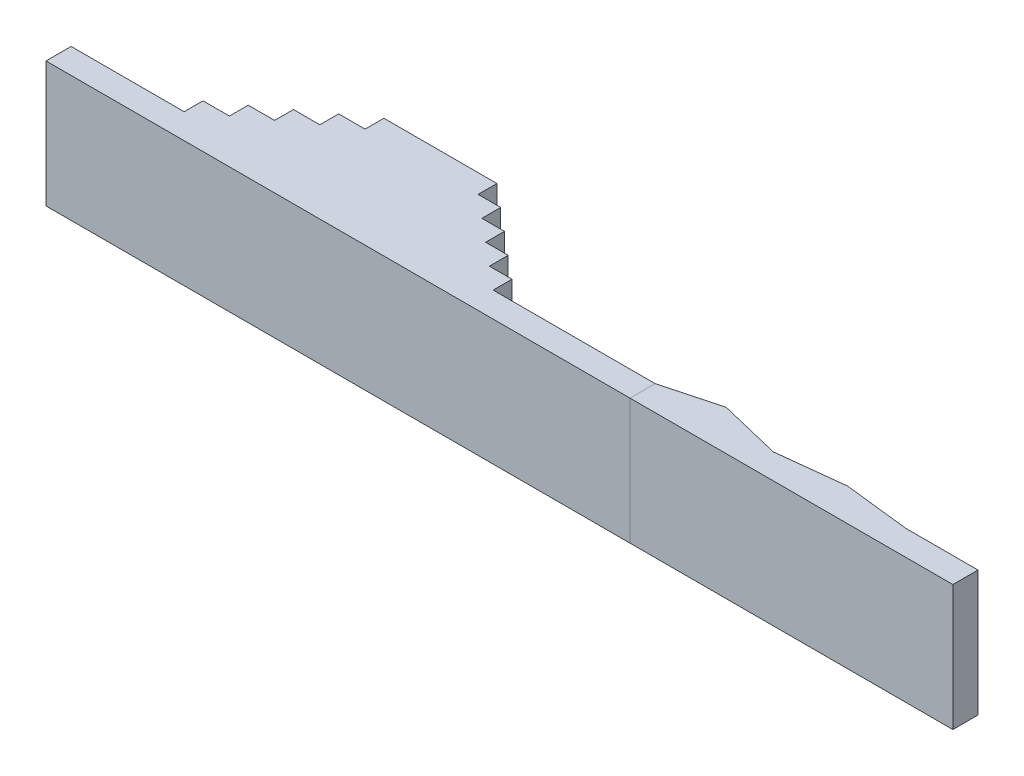
ISO-10303-21;
HEADER;
FILE_DESCRIPTION(('STEP AP214'),'2;1');
FILE_NAME('part.step','',(''),(''),'','','');
FILE_SCHEMA(('AUTOMOTIVE_DESIGN { 1 0 10303 214 1 1 1 1 }'));
ENDSEC;
DATA;
#1=APPLICATION_CONTEXT('core data for automotive mechanical design processes');
#2=APPLICATION_PROTOCOL_DEFINITION('international standard','automotive_design',2000,#1);
#3=PRODUCT_CONTEXT('',#1,'mechanical');
#4=PRODUCT('Part','Part','',(#3));
#5=PRODUCT_RELATED_PRODUCT_CATEGORY('part','',(#4));
#6=PRODUCT_DEFINITION_FORMATION('','',#4);
#7=PRODUCT_DEFINITION_CONTEXT('part definition',#1,'design');
#8=PRODUCT_DEFINITION('design','',#6,#7);
#9=PRODUCT_DEFINITION_SHAPE('','',#8);
#10=(LENGTH_UNIT() NAMED_UNIT(*) SI_UNIT(.MILLI.,.METRE.));
#11=(NAMED_UNIT(*) PLANE_ANGLE_UNIT() SI_UNIT($,.RADIAN.));
#12=(NAMED_UNIT(*) SI_UNIT($,.STERADIAN.) SOLID_ANGLE_UNIT());
#13=UNCERTAINTY_MEASURE_WITH_UNIT(LENGTH_MEASURE(1.E-05),#10,'distance_accuracy_value','');
#14=(GEOMETRIC_REPRESENTATION_CONTEXT(3) GLOBAL_UNCERTAINTY_ASSIGNED_CONTEXT((#13)) GLOBAL_UNIT_ASSIGNED_CONTEXT((#10,
#11,#12)) REPRESENTATION_CONTEXT('',''));
#15=CARTESIAN_POINT('',(0.,0.,0.));
#16=DIRECTION('',(0.,0.,1.));
#17=DIRECTION('',(1.,0.,0.));
#18=AXIS2_PLACEMENT_3D('',#15,#16,#17);
#19=CARTESIAN_POINT('',(3750.,0.,200.));
#20=DIRECTION('',(-1.,0.,0.));
#21=DIRECTION('',(0.,0.,1.));
#22=AXIS2_PLACEMENT_3D('',#19,#20,#21);
#23=PLANE('',#22);
#24=DIRECTION('',(0.,0.,1.));
#25=VECTOR('',#24,1.);
#26=CARTESIAN_POINT('',(3750.,1000.,200.));
#27=LINE('',#26,#25);
#28=CARTESIAN_POINT('',(3750.,1000.,0.));
#29=VERTEX_POINT('',#28);
#30=CARTESIAN_POINT('',(3750.,1000.,200.));
#31=VERTEX_POINT('',#30);
#32=EDGE_CURVE('E140',#29,#31,#27,.T.);
#33=ORIENTED_EDGE('',*,*,#32,.F.);
#34=DIRECTION('',(0.,1.,0.));
#35=VECTOR('',#34,1.);
#36=CARTESIAN_POINT('',(3750.,0.,0.));
#37=LINE('',#36,#35);
#38=CARTESIAN_POINT('',(3750.,0.,0.));
#39=VERTEX_POINT('',#38);
#40=EDGE_CURVE('E12',#39,#29,#37,.T.);
#41=ORIENTED_EDGE('',*,*,#40,.F.);
#42=DIRECTION('',(0.,0.,1.));
#43=VECTOR('',#42,1.);
#44=CARTESIAN_POINT('',(3750.,0.,200.));
#45=LINE('',#44,#43);
#46=CARTESIAN_POINT('',(3750.,0.,200.));
#47=VERTEX_POINT('',#46);
#48=EDGE_CURVE('E160',#39,#47,#45,.T.);
#49=ORIENTED_EDGE('',*,*,#48,.T.);
#50=DIRECTION('',(0.,1.,0.));
#51=VECTOR('',#50,1.);
#52=CARTESIAN_POINT('',(3750.,0.,200.));
#53=LINE('',#52,#51);
#54=EDGE_CURVE('E46',#47,#31,#53,.T.);
#55=ORIENTED_EDGE('',*,*,#54,.T.);
#56=EDGE_LOOP('',(#33,#41,#49,#55));
#57=FACE_BOUND('',#56,.T.);
#58=ADVANCED_FACE('F43',(#57),#23,.T.);
#59=CARTESIAN_POINT('',(3750.,0.,0.));
#60=DIRECTION('',(-0.25889091197546,0.,-0.965906566752973));
#61=DIRECTION('',(-0.965906566752973,0.,0.25889091197546));
#62=AXIS2_PLACEMENT_3D('',#59,#60,#61);
#63=PLANE('',#62);
#64=DIRECTION('',(-0.965906566752973,0.,0.25889091197546));
#65=VECTOR('',#64,1.);
#66=CARTESIAN_POINT('',(3750.,1000.,0.));
#67=LINE('',#66,#65);
#68=CARTESIAN_POINT('',(4196.04330054707,1000.,-119.552512462324));
#69=VERTEX_POINT('',#68);
#70=EDGE_CURVE('E158',#69,#29,#67,.T.);
#71=ORIENTED_EDGE('',*,*,#70,.F.);
#72=DIRECTION('',(0.,1.,0.));
#73=VECTOR('',#72,1.);
#74=CARTESIAN_POINT('',(4196.04330054707,0.,-119.552512462324));
#75=LINE('',#74,#73);
#76=CARTESIAN_POINT('',(4196.04330054707,0.,-119.552512462324));
#77=VERTEX_POINT('',#76);
#78=EDGE_CURVE('E52',#77,#69,#75,.T.);
#79=ORIENTED_EDGE('',*,*,#78,.F.);
#80=DIRECTION('',(-0.965906566752973,0.,0.25889091197546));
#81=VECTOR('',#80,1.);
#82=CARTESIAN_POINT('',(3750.,0.,0.));
#83=LINE('',#82,#81);
#84=EDGE_CURVE('E130',#77,#39,#83,.T.);
#85=ORIENTED_EDGE('',*,*,#84,.T.);
#86=ORIENTED_EDGE('',*,*,#40,.T.);
#87=EDGE_LOOP('',(#71,#79,#85,#86));
#88=FACE_BOUND('',#87,.T.);
#89=ADVANCED_FACE('F172',(#88),#63,.T.);
#90=CARTESIAN_POINT('',(4196.04330054707,0.,-119.552512462324));
#91=DIRECTION('',(0.23574080449088,0.,-0.97181596668196));
#92=DIRECTION('',(-0.97181596668196,0.,-0.23574080449088));
#93=AXIS2_PLACEMENT_3D('',#90,#91,#92);
#94=PLANE('',#93);
#95=DIRECTION('',(-0.97181596668196,0.,-0.23574080449088));
#96=VECTOR('',#95,1.);
#97=CARTESIAN_POINT('',(4196.04330054707,1000.,-119.552512462324));
#98=LINE('',#97,#96);
#99=CARTESIAN_POINT('',(4688.88560130509,1000.,0.));
#100=VERTEX_POINT('',#99);
#101=EDGE_CURVE('E117',#100,#69,#98,.T.);
#102=ORIENTED_EDGE('',*,*,#101,.F.);
#103=DIRECTION('',(0.,1.,0.));
#104=VECTOR('',#103,1.);
#105=CARTESIAN_POINT('',(4688.88560130509,0.,0.));
#106=LINE('',#105,#104);
#107=CARTESIAN_POINT('',(4688.88560130509,0.,0.));
#108=VERTEX_POINT('',#107);
#109=EDGE_CURVE('E112',#108,#100,#106,.T.);
#110=ORIENTED_EDGE('',*,*,#109,.F.);
#111=DIRECTION('',(-0.97181596668196,0.,-0.23574080449088));
#112=VECTOR('',#111,1.);
#113=CARTESIAN_POINT('',(4196.04330054707,0.,-119.552512462324));
#114=LINE('',#113,#112);
#115=EDGE_CURVE('E115',#108,#77,#114,.T.);
#116=ORIENTED_EDGE('',*,*,#115,.T.);
#117=ORIENTED_EDGE('',*,*,#78,.T.);
#118=EDGE_LOOP('',(#102,#110,#116,#117));
#119=FACE_BOUND('',#118,.T.);
#120=ADVANCED_FACE('F114',(#119),#94,.T.);
#121=CARTESIAN_POINT('',(4688.88560130509,0.,0.));
#122=DIRECTION('',(-0.111047419581196,0.,-0.993815108862991));
#123=DIRECTION('',(-0.993815108862991,0.,0.111047419581196));
#124=AXIS2_PLACEMENT_3D('',#121,#122,#123);
#125=PLANE('',#124);
#126=DIRECTION('',(-0.993815108862991,0.,0.111047419581196));
#127=VECTOR('',#126,1.);
#128=CARTESIAN_POINT('',(4688.88560130509,1000.,0.));
#129=LINE('',#128,#127);
#130=CARTESIAN_POINT('',(5223.85117563217,1000.,-59.7762562311622));
#131=VERTEX_POINT('',#130);
#132=EDGE_CURVE('E155',#131,#100,#129,.T.);
#133=ORIENTED_EDGE('',*,*,#132,.F.);
#134=DIRECTION('',(0.,1.,0.));
#135=VECTOR('',#134,1.);
#136=CARTESIAN_POINT('',(5223.85117563217,0.,-59.7762562311622));
#137=LINE('',#136,#135);
#138=CARTESIAN_POINT('',(5223.85117563217,0.,-59.7762562311622));
#139=VERTEX_POINT('',#138);
#140=EDGE_CURVE('E122',#139,#131,#137,.T.);
#141=ORIENTED_EDGE('',*,*,#140,.F.);
#142=DIRECTION('',(-0.993815108862991,0.,0.111047419581196));
#143=VECTOR('',#142,1.);
#144=CARTESIAN_POINT('',(4688.88560130509,0.,0.));
#145=LINE('',#144,#143);
#146=EDGE_CURVE('E128',#139,#108,#145,.T.);
#147=ORIENTED_EDGE('',*,*,#146,.T.);
#148=ORIENTED_EDGE('',*,*,#109,.T.);
#149=EDGE_LOOP('',(#133,#141,#147,#148));
#150=FACE_BOUND('',#149,.T.);
#151=ADVANCED_FACE('F132',(#150),#125,.T.);
#152=CARTESIAN_POINT('',(5223.85117563217,0.,-59.7762562311622));
#153=DIRECTION('',(0.113699723972013,0.,-0.993515159808187));
#154=DIRECTION('',(-0.993515159808187,0.,-0.113699723972013));
#155=AXIS2_PLACEMENT_3D('',#152,#153,#154);
#156=PLANE('',#155);
#157=DIRECTION('',(-0.993515159808187,0.,-0.113699723972013));
#158=VECTOR('',#157,1.);
#159=CARTESIAN_POINT('',(5223.85117563217,1000.,-59.7762562311622));
#160=LINE('',#159,#158);
#161=CARTESIAN_POINT('',(5746.17976788853,1000.,0.));
#162=VERTEX_POINT('',#161);
#163=EDGE_CURVE('E152',#162,#131,#160,.T.);
#164=ORIENTED_EDGE('',*,*,#163,.F.);
#165=DIRECTION('',(0.,1.,0.));
#166=VECTOR('',#165,1.);
#167=CARTESIAN_POINT('',(5746.17976788853,0.,0.));
#168=LINE('',#167,#166);
#169=CARTESIAN_POINT('',(5746.17976788853,0.,0.));
#170=VERTEX_POINT('',#169);
#171=EDGE_CURVE('E164',#170,#162,#168,.T.);
#172=ORIENTED_EDGE('',*,*,#171,.F.);
#173=DIRECTION('',(-0.993515159808187,0.,-0.113699723972013));
#174=VECTOR('',#173,1.);
#175=CARTESIAN_POINT('',(5223.85117563217,0.,-59.7762562311622));
#176=LINE('',#175,#174);
#177=EDGE_CURVE('E133',#170,#139,#176,.T.);
#178=ORIENTED_EDGE('',*,*,#177,.T.);
#179=ORIENTED_EDGE('',*,*,#140,.T.);
#180=EDGE_LOOP('',(#164,#172,#178,#179));
#181=FACE_BOUND('',#180,.T.);
#182=ADVANCED_FACE('F185',(#181),#156,.T.);
#183=CARTESIAN_POINT('',(5746.17976788853,0.,0.));
#184=DIRECTION('',(0.,0.,-1.));
#185=DIRECTION('',(-1.,0.,0.));
#186=AXIS2_PLACEMENT_3D('',#183,#184,#185);
#187=PLANE('',#186);
#188=DIRECTION('',(-1.,0.,0.));
#189=VECTOR('',#188,1.);
#190=CARTESIAN_POINT('',(5746.17976788853,1000.,0.));
#191=LINE('',#190,#189);
#192=CARTESIAN_POINT('',(6320.,1000.,0.));
#193=VERTEX_POINT('',#192);
#194=EDGE_CURVE('E149',#193,#162,#191,.T.);
#195=ORIENTED_EDGE('',*,*,#194,.F.);
#196=DIRECTION('',(0.,1.,0.));
#197=VECTOR('',#196,1.);
#198=CARTESIAN_POINT('',(6320.,0.,0.));
#199=LINE('',#198,#197);
#200=CARTESIAN_POINT('',(6320.,0.,0.));
#201=VERTEX_POINT('',#200);
#202=EDGE_CURVE('E166',#201,#193,#199,.T.);
#203=ORIENTED_EDGE('',*,*,#202,.F.);
#204=DIRECTION('',(-1.,0.,0.));
#205=VECTOR('',#204,1.);
#206=CARTESIAN_POINT('',(5746.17976788853,0.,0.));
#207=LINE('',#206,#205);
#208=EDGE_CURVE('E135',#201,#170,#207,.T.);
#209=ORIENTED_EDGE('',*,*,#208,.T.);
#210=ORIENTED_EDGE('',*,*,#171,.T.);
#211=EDGE_LOOP('',(#195,#203,#209,#210));
#212=FACE_BOUND('',#211,.T.);
#213=ADVANCED_FACE('F188',(#212),#187,.T.);
#214=CARTESIAN_POINT('',(6320.,0.,200.));
#215=DIRECTION('',(1.,0.,0.));
#216=DIRECTION('',(0.,0.,-1.));
#217=AXIS2_PLACEMENT_3D('',#214,#215,#216);
#218=PLANE('',#217);
#219=DIRECTION('',(0.,0.,-1.));
#220=VECTOR('',#219,1.);
#221=CARTESIAN_POINT('',(6320.,1000.,200.));
#222=LINE('',#221,#220);
#223=CARTESIAN_POINT('',(6320.,1000.,200.));
#224=VERTEX_POINT('',#223);
#225=EDGE_CURVE('E146',#224,#193,#222,.T.);
#226=ORIENTED_EDGE('',*,*,#225,.F.);
#227=DIRECTION('',(0.,1.,0.));
#228=VECTOR('',#227,1.);
#229=CARTESIAN_POINT('',(6320.,0.,200.));
#230=LINE('',#229,#228);
#231=CARTESIAN_POINT('',(6320.,0.,200.));
#232=VERTEX_POINT('',#231);
#233=EDGE_CURVE('E167',#232,#224,#230,.T.);
#234=ORIENTED_EDGE('',*,*,#233,.F.);
#235=DIRECTION('',(0.,0.,-1.));
#236=VECTOR('',#235,1.);
#237=CARTESIAN_POINT('',(6320.,0.,200.));
#238=LINE('',#237,#236);
#239=EDGE_CURVE('E263',#232,#201,#238,.T.);
#240=ORIENTED_EDGE('',*,*,#239,.T.);
#241=ORIENTED_EDGE('',*,*,#202,.T.);
#242=EDGE_LOOP('',(#226,#234,#240,#241));
#243=FACE_BOUND('',#242,.T.);
#244=ADVANCED_FACE('F192',(#243),#218,.T.);
#245=CARTESIAN_POINT('',(3750.,0.,200.));
#246=DIRECTION('',(0.,0.,1.));
#247=DIRECTION('',(1.,0.,0.));
#248=AXIS2_PLACEMENT_3D('',#245,#246,#247);
#249=PLANE('',#248);
#250=DIRECTION('',(1.,0.,0.));
#251=VECTOR('',#250,1.);
#252=CARTESIAN_POINT('',(3750.,1000.,200.));
#253=LINE('',#252,#251);
#254=EDGE_CURVE('E143',#31,#224,#253,.T.);
#255=ORIENTED_EDGE('',*,*,#254,.F.);
#256=ORIENTED_EDGE('',*,*,#54,.F.);
#257=DIRECTION('',(1.,0.,0.));
#258=VECTOR('',#257,1.);
#259=CARTESIAN_POINT('',(3750.,0.,200.));
#260=LINE('',#259,#258);
#261=EDGE_CURVE('E264',#47,#232,#260,.T.);
#262=ORIENTED_EDGE('',*,*,#261,.T.);
#263=ORIENTED_EDGE('',*,*,#233,.T.);
#264=EDGE_LOOP('',(#255,#256,#262,#263));
#265=FACE_BOUND('',#264,.T.);
#266=ADVANCED_FACE('F169',(#265),#249,.T.);
#267=CARTESIAN_POINT('',(0.,0.,0.));
#268=DIRECTION('',(0.,-1.,0.));
#269=DIRECTION('',(0.,0.,-1.));
#270=AXIS2_PLACEMENT_3D('',#267,#268,#269);
#271=PLANE('',#270);
#272=ORIENTED_EDGE('',*,*,#48,.F.);
#273=ORIENTED_EDGE('',*,*,#84,.F.);
#274=ORIENTED_EDGE('',*,*,#115,.F.);
#275=ORIENTED_EDGE('',*,*,#146,.F.);
#276=ORIENTED_EDGE('',*,*,#177,.F.);
#277=ORIENTED_EDGE('',*,*,#208,.F.);
#278=ORIENTED_EDGE('',*,*,#239,.F.);
#279=ORIENTED_EDGE('',*,*,#261,.F.);
#280=EDGE_LOOP('',(#272,#273,#274,#275,#276,#277,#278,#279));
#281=FACE_BOUND('',#280,.T.);
#282=ADVANCED_FACE('F126',(#281),#271,.T.);
#283=CARTESIAN_POINT('',(0.,1000.,0.));
#284=DIRECTION('',(0.,-1.,0.));
#285=DIRECTION('',(0.,0.,-1.));
#286=AXIS2_PLACEMENT_3D('',#283,#284,#285);
#287=PLANE('',#286);
#288=ORIENTED_EDGE('',*,*,#32,.T.);
#289=ORIENTED_EDGE('',*,*,#254,.T.);
#290=ORIENTED_EDGE('',*,*,#225,.T.);
#291=ORIENTED_EDGE('',*,*,#194,.T.);
#292=ORIENTED_EDGE('',*,*,#163,.T.);
#293=ORIENTED_EDGE('',*,*,#132,.T.);
#294=ORIENTED_EDGE('',*,*,#101,.T.);
#295=ORIENTED_EDGE('',*,*,#70,.T.);
#296=EDGE_LOOP('',(#288,#289,#290,#291,#292,#293,#294,#295));
#297=FACE_BOUND('',#296,.T.);
#298=ADVANCED_FACE('F171',(#297),#287,.F.);
#299=CLOSED_SHELL('',(#58,#89,#120,#151,#182,#213,#244,#266,#282,#298));
#300=MANIFOLD_SOLID_BREP('B2',#299);
#301=CARTESIAN_POINT('',(0.,1000.,0.));
#302=DIRECTION('',(0.,0.,1.));
#303=DIRECTION('',(1.,0.,0.));
#304=AXIS2_PLACEMENT_3D('',#301,#302,#303);
#305=PLANE('',#304);
#306=DIRECTION('',(-1.,0.,0.));
#307=VECTOR('',#306,1.);
#308=CARTESIAN_POINT('',(0.,0.,0.));
#309=LINE('',#308,#307);
#310=CARTESIAN_POINT('',(0.,0.,0.));
#311=VERTEX_POINT('',#310);
#312=CARTESIAN_POINT('',(-900.,0.,1.10218211923262E-13));
#313=VERTEX_POINT('',#312);
#314=EDGE_CURVE('E463',#311,#313,#309,.T.);
#315=ORIENTED_EDGE('',*,*,#314,.T.);
#316=DIRECTION('',(0.,-1.,0.));
#317=VECTOR('',#316,1.);
#318=CARTESIAN_POINT('',(-900.,1000.,1.10218211923262E-13));
#319=LINE('',#318,#317);
#320=CARTESIAN_POINT('',(-900.,1000.,1.10218211923262E-13));
#321=VERTEX_POINT('',#320);
#322=EDGE_CURVE('E41',#321,#313,#319,.T.);
#323=ORIENTED_EDGE('',*,*,#322,.F.);
#324=DIRECTION('',(-1.,0.,0.));
#325=VECTOR('',#324,1.);
#326=CARTESIAN_POINT('',(0.,1000.,0.));
#327=LINE('',#326,#325);
#328=CARTESIAN_POINT('',(0.,1000.,0.));
#329=VERTEX_POINT('',#328);
#330=EDGE_CURVE('E509',#329,#321,#327,.T.);
#331=ORIENTED_EDGE('',*,*,#330,.F.);
#332=DIRECTION('',(0.,-1.,0.));
#333=VECTOR('',#332,1.);
#334=CARTESIAN_POINT('',(0.,1000.,0.));
#335=LINE('',#334,#333);
#336=EDGE_CURVE('E459',#329,#311,#335,.T.);
#337=ORIENTED_EDGE('',*,*,#336,.T.);
#338=EDGE_LOOP('',(#315,#323,#331,#337));
#339=FACE_BOUND('',#338,.T.);
#340=ADVANCED_FACE('F271',(#339),#305,.F.);
#341=CARTESIAN_POINT('',(-900.,1000.,1.10218211923262E-13));
#342=DIRECTION('',(1.,0.,0.));
#343=DIRECTION('',(0.,0.,-1.));
#344=AXIS2_PLACEMENT_3D('',#341,#342,#343);
#345=PLANE('',#344);
#346=DIRECTION('',(0.,0.,1.));
#347=VECTOR('',#346,1.);
#348=CARTESIAN_POINT('',(-900.,0.,1.10218211923262E-13));
#349=LINE('',#348,#347);
#350=CARTESIAN_POINT('',(-900.,0.,200.));
#351=VERTEX_POINT('',#350);
#352=EDGE_CURVE('E466',#313,#351,#349,.T.);
#353=ORIENTED_EDGE('',*,*,#352,.T.);
#354=DIRECTION('',(0.,-1.,0.));
#355=VECTOR('',#354,1.);
#356=CARTESIAN_POINT('',(-900.,1000.,200.));
#357=LINE('',#356,#355);
#358=CARTESIAN_POINT('',(-900.,1000.,200.));
#359=VERTEX_POINT('',#358);
#360=EDGE_CURVE('E279',#359,#351,#357,.T.);
#361=ORIENTED_EDGE('',*,*,#360,.F.);
#362=DIRECTION('',(0.,0.,1.));
#363=VECTOR('',#362,1.);
#364=CARTESIAN_POINT('',(-900.,1000.,1.10218211923262E-13));
#365=LINE('',#364,#363);
#366=EDGE_CURVE('E378',#321,#359,#365,.T.);
#367=ORIENTED_EDGE('',*,*,#366,.F.);
#368=ORIENTED_EDGE('',*,*,#322,.T.);
#369=EDGE_LOOP('',(#353,#361,#367,#368));
#370=FACE_BOUND('',#369,.T.);
#371=ADVANCED_FACE('F647',(#370),#345,.F.);
#372=CARTESIAN_POINT('',(-900.,1000.,200.));
#373=DIRECTION('',(0.,0.,-1.));
#374=DIRECTION('',(-1.,0.,0.));
#375=AXIS2_PLACEMENT_3D('',#372,#373,#374);
#376=PLANE('',#375);
#377=DIRECTION('',(1.,0.,0.));
#378=VECTOR('',#377,1.);
#379=CARTESIAN_POINT('',(-900.,0.,200.));
#380=LINE('',#379,#378);
#381=CARTESIAN_POINT('',(3750.,0.,200.));
#382=VERTEX_POINT('',#381);
#383=EDGE_CURVE('E468',#351,#382,#380,.T.);
#384=ORIENTED_EDGE('',*,*,#383,.T.);
#385=DIRECTION('',(0.,-1.,0.));
#386=VECTOR('',#385,1.);
#387=CARTESIAN_POINT('',(3750.,1000.,200.));
#388=LINE('',#387,#386);
#389=CARTESIAN_POINT('',(3750.,1000.,200.));
#390=VERTEX_POINT('',#389);
#391=EDGE_CURVE('E564',#390,#382,#388,.T.);
#392=ORIENTED_EDGE('',*,*,#391,.F.);
#393=DIRECTION('',(1.,0.,0.));
#394=VECTOR('',#393,1.);
#395=CARTESIAN_POINT('',(-900.,1000.,200.));
#396=LINE('',#395,#394);
#397=EDGE_CURVE('E572',#359,#390,#396,.T.);
#398=ORIENTED_EDGE('',*,*,#397,.F.);
#399=ORIENTED_EDGE('',*,*,#360,.T.);
#400=EDGE_LOOP('',(#384,#392,#398,#399));
#401=FACE_BOUND('',#400,.T.);
#402=ADVANCED_FACE('F570',(#401),#376,.F.);
#403=CARTESIAN_POINT('',(3750.,1000.,0.));
#404=DIRECTION('',(-1.,0.,0.));
#405=DIRECTION('',(0.,0.,1.));
#406=AXIS2_PLACEMENT_3D('',#403,#404,#405);
#407=PLANE('',#406);
#408=DIRECTION('',(0.,0.,-1.));
#409=VECTOR('',#408,1.);
#410=CARTESIAN_POINT('',(3750.,0.,0.));
#411=LINE('',#410,#409);
#412=CARTESIAN_POINT('',(3750.,0.,0.));
#413=VERTEX_POINT('',#412);
#414=EDGE_CURVE('E470',#382,#413,#411,.T.);
#415=ORIENTED_EDGE('',*,*,#414,.T.);
#416=DIRECTION('',(0.,-1.,0.));
#417=VECTOR('',#416,1.);
#418=CARTESIAN_POINT('',(3750.,1000.,0.));
#419=LINE('',#418,#417);
#420=CARTESIAN_POINT('',(3750.,1000.,0.));
#421=VERTEX_POINT('',#420);
#422=EDGE_CURVE('E561',#421,#413,#419,.T.);
#423=ORIENTED_EDGE('',*,*,#422,.F.);
#424=DIRECTION('',(0.,0.,-1.));
#425=VECTOR('',#424,1.);
#426=CARTESIAN_POINT('',(3750.,1000.,0.));
#427=LINE('',#426,#425);
#428=EDGE_CURVE('E590',#390,#421,#427,.T.);
#429=ORIENTED_EDGE('',*,*,#428,.F.);
#430=ORIENTED_EDGE('',*,*,#391,.T.);
#431=EDGE_LOOP('',(#415,#423,#429,#430));
#432=FACE_BOUND('',#431,.T.);
#433=ADVANCED_FACE('F581',(#432),#407,.F.);
#434=CARTESIAN_POINT('',(2460.,1000.,0.));
#435=DIRECTION('',(0.,0.,1.));
#436=DIRECTION('',(1.,0.,0.));
#437=AXIS2_PLACEMENT_3D('',#434,#435,#436);
#438=PLANE('',#437);
#439=DIRECTION('',(-1.,0.,0.));
#440=VECTOR('',#439,1.);
#441=CARTESIAN_POINT('',(2460.,0.,0.));
#442=LINE('',#441,#440);
#443=CARTESIAN_POINT('',(2460.,0.,0.));
#444=VERTEX_POINT('',#443);
#445=EDGE_CURVE('E472',#413,#444,#442,.T.);
#446=ORIENTED_EDGE('',*,*,#445,.T.);
#447=DIRECTION('',(0.,-1.,0.));
#448=VECTOR('',#447,1.);
#449=CARTESIAN_POINT('',(2460.,1000.,0.));
#450=LINE('',#449,#448);
#451=CARTESIAN_POINT('',(2460.,1000.,0.));
#452=VERTEX_POINT('',#451);
#453=EDGE_CURVE('E558',#452,#444,#450,.T.);
#454=ORIENTED_EDGE('',*,*,#453,.F.);
#455=DIRECTION('',(-1.,0.,0.));
#456=VECTOR('',#455,1.);
#457=CARTESIAN_POINT('',(2460.,1000.,0.));
#458=LINE('',#457,#456);
#459=EDGE_CURVE('E587',#421,#452,#458,.T.);
#460=ORIENTED_EDGE('',*,*,#459,.F.);
#461=ORIENTED_EDGE('',*,*,#422,.T.);
#462=EDGE_LOOP('',(#446,#454,#460,#461));
#463=FACE_BOUND('',#462,.T.);
#464=ADVANCED_FACE('F585',(#463),#438,.F.);
#465=CARTESIAN_POINT('',(2460.,1000.,-150.));
#466=DIRECTION('',(-1.,0.,0.));
#467=DIRECTION('',(0.,0.,1.));
#468=AXIS2_PLACEMENT_3D('',#465,#466,#467);
#469=PLANE('',#468);
#470=DIRECTION('',(0.,0.,-1.));
#471=VECTOR('',#470,1.);
#472=CARTESIAN_POINT('',(2460.,0.,-150.));
#473=LINE('',#472,#471);
#474=CARTESIAN_POINT('',(2460.,0.,-150.));
#475=VERTEX_POINT('',#474);
#476=EDGE_CURVE('E474',#444,#475,#473,.T.);
#477=ORIENTED_EDGE('',*,*,#476,.T.);
#478=DIRECTION('',(0.,-1.,0.));
#479=VECTOR('',#478,1.);
#480=CARTESIAN_POINT('',(2460.,1000.,-150.));
#481=LINE('',#480,#479);
#482=CARTESIAN_POINT('',(2460.,1000.,-150.));
#483=VERTEX_POINT('',#482);
#484=EDGE_CURVE('E555',#483,#475,#481,.T.);
#485=ORIENTED_EDGE('',*,*,#484,.F.);
#486=DIRECTION('',(0.,0.,-1.));
#487=VECTOR('',#486,1.);
#488=CARTESIAN_POINT('',(2460.,1000.,-150.));
#489=LINE('',#488,#487);
#490=EDGE_CURVE('E589',#452,#483,#489,.T.);
#491=ORIENTED_EDGE('',*,*,#490,.F.);
#492=ORIENTED_EDGE('',*,*,#453,.T.);
#493=EDGE_LOOP('',(#477,#485,#491,#492));
#494=FACE_BOUND('',#493,.T.);
#495=ADVANCED_FACE('F660',(#494),#469,.F.);
#496=CARTESIAN_POINT('',(2280.,1000.,-150.));
#497=DIRECTION('',(0.,0.,1.));
#498=DIRECTION('',(1.,0.,0.));
#499=AXIS2_PLACEMENT_3D('',#496,#497,#498);
#500=PLANE('',#499);
#501=DIRECTION('',(-1.,0.,0.));
#502=VECTOR('',#501,1.);
#503=CARTESIAN_POINT('',(2280.,0.,-150.));
#504=LINE('',#503,#502);
#505=CARTESIAN_POINT('',(2280.,0.,-150.));
#506=VERTEX_POINT('',#505);
#507=EDGE_CURVE('E476',#475,#506,#504,.T.);
#508=ORIENTED_EDGE('',*,*,#507,.T.);
#509=DIRECTION('',(0.,-1.,0.));
#510=VECTOR('',#509,1.);
#511=CARTESIAN_POINT('',(2280.,1000.,-150.));
#512=LINE('',#511,#510);
#513=CARTESIAN_POINT('',(2280.,1000.,-150.));
#514=VERTEX_POINT('',#513);
#515=EDGE_CURVE('E552',#514,#506,#512,.T.);
#516=ORIENTED_EDGE('',*,*,#515,.F.);
#517=DIRECTION('',(-1.,0.,0.));
#518=VECTOR('',#517,1.);
#519=CARTESIAN_POINT('',(2280.,1000.,-150.));
#520=LINE('',#519,#518);
#521=EDGE_CURVE('E592',#483,#514,#520,.T.);
#522=ORIENTED_EDGE('',*,*,#521,.F.);
#523=ORIENTED_EDGE('',*,*,#484,.T.);
#524=EDGE_LOOP('',(#508,#516,#522,#523));
#525=FACE_BOUND('',#524,.T.);
#526=ADVANCED_FACE('F663',(#525),#500,.F.);
#527=CARTESIAN_POINT('',(2280.,1000.,-300.));
#528=DIRECTION('',(-1.,0.,0.));
#529=DIRECTION('',(0.,0.,1.));
#530=AXIS2_PLACEMENT_3D('',#527,#528,#529);
#531=PLANE('',#530);
#532=DIRECTION('',(0.,0.,-1.));
#533=VECTOR('',#532,1.);
#534=CARTESIAN_POINT('',(2280.,0.,-300.));
#535=LINE('',#534,#533);
#536=CARTESIAN_POINT('',(2280.,0.,-300.));
#537=VERTEX_POINT('',#536);
#538=EDGE_CURVE('E478',#506,#537,#535,.T.);
#539=ORIENTED_EDGE('',*,*,#538,.T.);
#540=DIRECTION('',(0.,-1.,0.));
#541=VECTOR('',#540,1.);
#542=CARTESIAN_POINT('',(2280.,1000.,-300.));
#543=LINE('',#542,#541);
#544=CARTESIAN_POINT('',(2280.,1000.,-300.));
#545=VERTEX_POINT('',#544);
#546=EDGE_CURVE('E549',#545,#537,#543,.T.);
#547=ORIENTED_EDGE('',*,*,#546,.F.);
#548=DIRECTION('',(0.,0.,-1.));
#549=VECTOR('',#548,1.);
#550=CARTESIAN_POINT('',(2280.,1000.,-300.));
#551=LINE('',#550,#549);
#552=EDGE_CURVE('E598',#514,#545,#551,.T.);
#553=ORIENTED_EDGE('',*,*,#552,.F.);
#554=ORIENTED_EDGE('',*,*,#515,.T.);
#555=EDGE_LOOP('',(#539,#547,#553,#554));
#556=FACE_BOUND('',#555,.T.);
#557=ADVANCED_FACE('F667',(#556),#531,.F.);
#558=CARTESIAN_POINT('',(2100.,1000.,-300.));
#559=DIRECTION('',(0.,0.,1.));
#560=DIRECTION('',(1.,0.,0.));
#561=AXIS2_PLACEMENT_3D('',#558,#559,#560);
#562=PLANE('',#561);
#563=DIRECTION('',(-1.,0.,0.));
#564=VECTOR('',#563,1.);
#565=CARTESIAN_POINT('',(2100.,0.,-300.));
#566=LINE('',#565,#564);
#567=CARTESIAN_POINT('',(2100.,0.,-300.));
#568=VERTEX_POINT('',#567);
#569=EDGE_CURVE('E480',#537,#568,#566,.T.);
#570=ORIENTED_EDGE('',*,*,#569,.T.);
#571=DIRECTION('',(0.,-1.,0.));
#572=VECTOR('',#571,1.);
#573=CARTESIAN_POINT('',(2100.,1000.,-300.));
#574=LINE('',#573,#572);
#575=CARTESIAN_POINT('',(2100.,1000.,-300.));
#576=VERTEX_POINT('',#575);
#577=EDGE_CURVE('E546',#576,#568,#574,.T.);
#578=ORIENTED_EDGE('',*,*,#577,.F.);
#579=DIRECTION('',(-1.,0.,0.));
#580=VECTOR('',#579,1.);
#581=CARTESIAN_POINT('',(2100.,1000.,-300.));
#582=LINE('',#581,#580);
#583=EDGE_CURVE('E600',#545,#576,#582,.T.);
#584=ORIENTED_EDGE('',*,*,#583,.F.);
#585=ORIENTED_EDGE('',*,*,#546,.T.);
#586=EDGE_LOOP('',(#570,#578,#584,#585));
#587=FACE_BOUND('',#586,.T.);
#588=ADVANCED_FACE('F671',(#587),#562,.F.);
#589=CARTESIAN_POINT('',(2100.,1000.,-450.));
#590=DIRECTION('',(-1.,0.,0.));
#591=DIRECTION('',(0.,0.,1.));
#592=AXIS2_PLACEMENT_3D('',#589,#590,#591);
#593=PLANE('',#592);
#594=DIRECTION('',(0.,0.,-1.));
#595=VECTOR('',#594,1.);
#596=CARTESIAN_POINT('',(2100.,0.,-450.));
#597=LINE('',#596,#595);
#598=CARTESIAN_POINT('',(2100.,0.,-450.));
#599=VERTEX_POINT('',#598);
#600=EDGE_CURVE('E482',#568,#599,#597,.T.);
#601=ORIENTED_EDGE('',*,*,#600,.T.);
#602=DIRECTION('',(0.,-1.,0.));
#603=VECTOR('',#602,1.);
#604=CARTESIAN_POINT('',(2100.,1000.,-450.));
#605=LINE('',#604,#603);
#606=CARTESIAN_POINT('',(2100.,1000.,-450.));
#607=VERTEX_POINT('',#606);
#608=EDGE_CURVE('E543',#607,#599,#605,.T.);
#609=ORIENTED_EDGE('',*,*,#608,.F.);
#610=DIRECTION('',(0.,0.,-1.));
#611=VECTOR('',#610,1.);
#612=CARTESIAN_POINT('',(2100.,1000.,-450.));
#613=LINE('',#612,#611);
#614=EDGE_CURVE('E602',#576,#607,#613,.T.);
#615=ORIENTED_EDGE('',*,*,#614,.F.);
#616=ORIENTED_EDGE('',*,*,#577,.T.);
#617=EDGE_LOOP('',(#601,#609,#615,#616));
#618=FACE_BOUND('',#617,.T.);
#619=ADVANCED_FACE('F675',(#618),#593,.F.);
#620=CARTESIAN_POINT('',(1920.,1000.,-450.));
#621=DIRECTION('',(0.,0.,1.));
#622=DIRECTION('',(1.,0.,0.));
#623=AXIS2_PLACEMENT_3D('',#620,#621,#622);
#624=PLANE('',#623);
#625=DIRECTION('',(-1.,0.,0.));
#626=VECTOR('',#625,1.);
#627=CARTESIAN_POINT('',(1920.,0.,-450.));
#628=LINE('',#627,#626);
#629=CARTESIAN_POINT('',(1920.,0.,-450.));
#630=VERTEX_POINT('',#629);
#631=EDGE_CURVE('E484',#599,#630,#628,.T.);
#632=ORIENTED_EDGE('',*,*,#631,.T.);
#633=DIRECTION('',(0.,-1.,0.));
#634=VECTOR('',#633,1.);
#635=CARTESIAN_POINT('',(1920.,1000.,-450.));
#636=LINE('',#635,#634);
#637=CARTESIAN_POINT('',(1920.,1000.,-450.));
#638=VERTEX_POINT('',#637);
#639=EDGE_CURVE('E540',#638,#630,#636,.T.);
#640=ORIENTED_EDGE('',*,*,#639,.F.);
#641=DIRECTION('',(-1.,0.,0.));
#642=VECTOR('',#641,1.);
#643=CARTESIAN_POINT('',(1920.,1000.,-450.));
#644=LINE('',#643,#642);
#645=EDGE_CURVE('E604',#607,#638,#644,.T.);
#646=ORIENTED_EDGE('',*,*,#645,.F.);
#647=ORIENTED_EDGE('',*,*,#608,.T.);
#648=EDGE_LOOP('',(#632,#640,#646,#647));
#649=FACE_BOUND('',#648,.T.);
#650=ADVANCED_FACE('F679',(#649),#624,.F.);
#651=CARTESIAN_POINT('',(1920.,1000.,-600.));
#652=DIRECTION('',(-1.,0.,0.));
#653=DIRECTION('',(0.,0.,1.));
#654=AXIS2_PLACEMENT_3D('',#651,#652,#653);
#655=PLANE('',#654);
#656=DIRECTION('',(0.,0.,-1.));
#657=VECTOR('',#656,1.);
#658=CARTESIAN_POINT('',(1920.,0.,-600.));
#659=LINE('',#658,#657);
#660=CARTESIAN_POINT('',(1920.,0.,-600.));
#661=VERTEX_POINT('',#660);
#662=EDGE_CURVE('E486',#630,#661,#659,.T.);
#663=ORIENTED_EDGE('',*,*,#662,.T.);
#664=DIRECTION('',(0.,-1.,0.));
#665=VECTOR('',#664,1.);
#666=CARTESIAN_POINT('',(1920.,1000.,-600.));
#667=LINE('',#666,#665);
#668=CARTESIAN_POINT('',(1920.,1000.,-600.));
#669=VERTEX_POINT('',#668);
#670=EDGE_CURVE('E537',#669,#661,#667,.T.);
#671=ORIENTED_EDGE('',*,*,#670,.F.);
#672=DIRECTION('',(0.,0.,-1.));
#673=VECTOR('',#672,1.);
#674=CARTESIAN_POINT('',(1920.,1000.,-600.));
#675=LINE('',#674,#673);
#676=EDGE_CURVE('E606',#638,#669,#675,.T.);
#677=ORIENTED_EDGE('',*,*,#676,.F.);
#678=ORIENTED_EDGE('',*,*,#639,.T.);
#679=EDGE_LOOP('',(#663,#671,#677,#678));
#680=FACE_BOUND('',#679,.T.);
#681=ADVANCED_FACE('F683',(#680),#655,.F.);
#682=CARTESIAN_POINT('',(1740.,1000.,-600.));
#683=DIRECTION('',(0.,0.,1.));
#684=DIRECTION('',(1.,0.,0.));
#685=AXIS2_PLACEMENT_3D('',#682,#683,#684);
#686=PLANE('',#685);
#687=DIRECTION('',(-1.,0.,0.));
#688=VECTOR('',#687,1.);
#689=CARTESIAN_POINT('',(1740.,0.,-600.));
#690=LINE('',#689,#688);
#691=CARTESIAN_POINT('',(1740.,0.,-600.));
#692=VERTEX_POINT('',#691);
#693=EDGE_CURVE('E488',#661,#692,#690,.T.);
#694=ORIENTED_EDGE('',*,*,#693,.T.);
#695=DIRECTION('',(0.,-1.,0.));
#696=VECTOR('',#695,1.);
#697=CARTESIAN_POINT('',(1740.,1000.,-600.));
#698=LINE('',#697,#696);
#699=CARTESIAN_POINT('',(1740.,1000.,-600.));
#700=VERTEX_POINT('',#699);
#701=EDGE_CURVE('E534',#700,#692,#698,.T.);
#702=ORIENTED_EDGE('',*,*,#701,.F.);
#703=DIRECTION('',(-1.,0.,0.));
#704=VECTOR('',#703,1.);
#705=CARTESIAN_POINT('',(1740.,1000.,-600.));
#706=LINE('',#705,#704);
#707=EDGE_CURVE('E608',#669,#700,#706,.T.);
#708=ORIENTED_EDGE('',*,*,#707,.F.);
#709=ORIENTED_EDGE('',*,*,#670,.T.);
#710=EDGE_LOOP('',(#694,#702,#708,#709));
#711=FACE_BOUND('',#710,.T.);
#712=ADVANCED_FACE('F687',(#711),#686,.F.);
#713=CARTESIAN_POINT('',(1740.,1000.,-750.));
#714=DIRECTION('',(-1.,0.,0.));
#715=DIRECTION('',(0.,0.,1.));
#716=AXIS2_PLACEMENT_3D('',#713,#714,#715);
#717=PLANE('',#716);
#718=DIRECTION('',(0.,0.,-1.));
#719=VECTOR('',#718,1.);
#720=CARTESIAN_POINT('',(1740.,0.,-750.));
#721=LINE('',#720,#719);
#722=CARTESIAN_POINT('',(1740.,0.,-750.));
#723=VERTEX_POINT('',#722);
#724=EDGE_CURVE('E490',#692,#723,#721,.T.);
#725=ORIENTED_EDGE('',*,*,#724,.T.);
#726=DIRECTION('',(0.,-1.,0.));
#727=VECTOR('',#726,1.);
#728=CARTESIAN_POINT('',(1740.,1000.,-750.));
#729=LINE('',#728,#727);
#730=CARTESIAN_POINT('',(1740.,1000.,-750.));
#731=VERTEX_POINT('',#730);
#732=EDGE_CURVE('E531',#731,#723,#729,.T.);
#733=ORIENTED_EDGE('',*,*,#732,.F.);
#734=DIRECTION('',(0.,0.,-1.));
#735=VECTOR('',#734,1.);
#736=CARTESIAN_POINT('',(1740.,1000.,-750.));
#737=LINE('',#736,#735);
#738=EDGE_CURVE('E610',#700,#731,#737,.T.);
#739=ORIENTED_EDGE('',*,*,#738,.F.);
#740=ORIENTED_EDGE('',*,*,#701,.T.);
#741=EDGE_LOOP('',(#725,#733,#739,#740));
#742=FACE_BOUND('',#741,.T.);
#743=ADVANCED_FACE('F691',(#742),#717,.F.);
#744=CARTESIAN_POINT('',(840.,1000.,-750.));
#745=DIRECTION('',(0.,0.,1.));
#746=DIRECTION('',(1.,0.,0.));
#747=AXIS2_PLACEMENT_3D('',#744,#745,#746);
#748=PLANE('',#747);
#749=DIRECTION('',(-1.,0.,0.));
#750=VECTOR('',#749,1.);
#751=CARTESIAN_POINT('',(840.,0.,-750.));
#752=LINE('',#751,#750);
#753=CARTESIAN_POINT('',(840.,0.,-750.));
#754=VERTEX_POINT('',#753);
#755=EDGE_CURVE('E492',#723,#754,#752,.T.);
#756=ORIENTED_EDGE('',*,*,#755,.T.);
#757=DIRECTION('',(0.,-1.,0.));
#758=VECTOR('',#757,1.);
#759=CARTESIAN_POINT('',(840.,1000.,-750.));
#760=LINE('',#759,#758);
#761=CARTESIAN_POINT('',(840.,1000.,-750.));
#762=VERTEX_POINT('',#761);
#763=EDGE_CURVE('E528',#762,#754,#760,.T.);
#764=ORIENTED_EDGE('',*,*,#763,.F.);
#765=DIRECTION('',(-1.,0.,0.));
#766=VECTOR('',#765,1.);
#767=CARTESIAN_POINT('',(840.,1000.,-750.));
#768=LINE('',#767,#766);
#769=EDGE_CURVE('E612',#731,#762,#768,.T.);
#770=ORIENTED_EDGE('',*,*,#769,.F.);
#771=ORIENTED_EDGE('',*,*,#732,.T.);
#772=EDGE_LOOP('',(#756,#764,#770,#771));
#773=FACE_BOUND('',#772,.T.);
#774=ADVANCED_FACE('F695',(#773),#748,.F.);
#775=CARTESIAN_POINT('',(840.,1000.,-600.));
#776=DIRECTION('',(1.,0.,0.));
#777=DIRECTION('',(0.,0.,-1.));
#778=AXIS2_PLACEMENT_3D('',#775,#776,#777);
#779=PLANE('',#778);
#780=DIRECTION('',(0.,0.,1.));
#781=VECTOR('',#780,1.);
#782=CARTESIAN_POINT('',(840.,0.,-600.));
#783=LINE('',#782,#781);
#784=CARTESIAN_POINT('',(840.,0.,-600.));
#785=VERTEX_POINT('',#784);
#786=EDGE_CURVE('E494',#754,#785,#783,.T.);
#787=ORIENTED_EDGE('',*,*,#786,.T.);
#788=DIRECTION('',(0.,-1.,0.));
#789=VECTOR('',#788,1.);
#790=CARTESIAN_POINT('',(840.,1000.,-600.));
#791=LINE('',#790,#789);
#792=CARTESIAN_POINT('',(840.,1000.,-600.));
#793=VERTEX_POINT('',#792);
#794=EDGE_CURVE('E525',#793,#785,#791,.T.);
#795=ORIENTED_EDGE('',*,*,#794,.F.);
#796=DIRECTION('',(0.,0.,1.));
#797=VECTOR('',#796,1.);
#798=CARTESIAN_POINT('',(840.,1000.,-600.));
#799=LINE('',#798,#797);
#800=EDGE_CURVE('E614',#762,#793,#799,.T.);
#801=ORIENTED_EDGE('',*,*,#800,.F.);
#802=ORIENTED_EDGE('',*,*,#763,.T.);
#803=EDGE_LOOP('',(#787,#795,#801,#802));
#804=FACE_BOUND('',#803,.T.);
#805=ADVANCED_FACE('F699',(#804),#779,.F.);
#806=CARTESIAN_POINT('',(630.,1000.,-600.));
#807=DIRECTION('',(0.,0.,1.));
#808=DIRECTION('',(1.,0.,0.));
#809=AXIS2_PLACEMENT_3D('',#806,#807,#808);
#810=PLANE('',#809);
#811=DIRECTION('',(-1.,0.,0.));
#812=VECTOR('',#811,1.);
#813=CARTESIAN_POINT('',(630.,0.,-600.));
#814=LINE('',#813,#812);
#815=CARTESIAN_POINT('',(630.,0.,-600.));
#816=VERTEX_POINT('',#815);
#817=EDGE_CURVE('E496',#785,#816,#814,.T.);
#818=ORIENTED_EDGE('',*,*,#817,.T.);
#819=DIRECTION('',(0.,-1.,0.));
#820=VECTOR('',#819,1.);
#821=CARTESIAN_POINT('',(630.,1000.,-600.));
#822=LINE('',#821,#820);
#823=CARTESIAN_POINT('',(630.,1000.,-600.));
#824=VERTEX_POINT('',#823);
#825=EDGE_CURVE('E522',#824,#816,#822,.T.);
#826=ORIENTED_EDGE('',*,*,#825,.F.);
#827=DIRECTION('',(-1.,0.,0.));
#828=VECTOR('',#827,1.);
#829=CARTESIAN_POINT('',(630.,1000.,-600.));
#830=LINE('',#829,#828);
#831=EDGE_CURVE('E616',#793,#824,#830,.T.);
#832=ORIENTED_EDGE('',*,*,#831,.F.);
#833=ORIENTED_EDGE('',*,*,#794,.T.);
#834=EDGE_LOOP('',(#818,#826,#832,#833));
#835=FACE_BOUND('',#834,.T.);
#836=ADVANCED_FACE('F703',(#835),#810,.F.);
#837=CARTESIAN_POINT('',(630.,1000.,-450.));
#838=DIRECTION('',(1.,0.,0.));
#839=DIRECTION('',(0.,0.,-1.));
#840=AXIS2_PLACEMENT_3D('',#837,#838,#839);
#841=PLANE('',#840);
#842=DIRECTION('',(0.,0.,1.));
#843=VECTOR('',#842,1.);
#844=CARTESIAN_POINT('',(630.,0.,-450.));
#845=LINE('',#844,#843);
#846=CARTESIAN_POINT('',(630.,0.,-450.));
#847=VERTEX_POINT('',#846);
#848=EDGE_CURVE('E498',#816,#847,#845,.T.);
#849=ORIENTED_EDGE('',*,*,#848,.T.);
#850=DIRECTION('',(0.,-1.,0.));
#851=VECTOR('',#850,1.);
#852=CARTESIAN_POINT('',(630.,1000.,-450.));
#853=LINE('',#852,#851);
#854=CARTESIAN_POINT('',(630.,1000.,-450.));
#855=VERTEX_POINT('',#854);
#856=EDGE_CURVE('E519',#855,#847,#853,.T.);
#857=ORIENTED_EDGE('',*,*,#856,.F.);
#858=DIRECTION('',(0.,0.,1.));
#859=VECTOR('',#858,1.);
#860=CARTESIAN_POINT('',(630.,1000.,-450.));
#861=LINE('',#860,#859);
#862=EDGE_CURVE('E618',#824,#855,#861,.T.);
#863=ORIENTED_EDGE('',*,*,#862,.F.);
#864=ORIENTED_EDGE('',*,*,#825,.T.);
#865=EDGE_LOOP('',(#849,#857,#863,#864));
#866=FACE_BOUND('',#865,.T.);
#867=ADVANCED_FACE('F707',(#866),#841,.F.);
#868=CARTESIAN_POINT('',(420.,1000.,-450.));
#869=DIRECTION('',(0.,0.,1.));
#870=DIRECTION('',(1.,0.,0.));
#871=AXIS2_PLACEMENT_3D('',#868,#869,#870);
#872=PLANE('',#871);
#873=DIRECTION('',(-1.,0.,0.));
#874=VECTOR('',#873,1.);
#875=CARTESIAN_POINT('',(420.,0.,-450.));
#876=LINE('',#875,#874);
#877=CARTESIAN_POINT('',(420.,0.,-450.));
#878=VERTEX_POINT('',#877);
#879=EDGE_CURVE('E500',#847,#878,#876,.T.);
#880=ORIENTED_EDGE('',*,*,#879,.T.);
#881=DIRECTION('',(0.,-1.,0.));
#882=VECTOR('',#881,1.);
#883=CARTESIAN_POINT('',(420.,1000.,-450.));
#884=LINE('',#883,#882);
#885=CARTESIAN_POINT('',(420.,1000.,-450.));
#886=VERTEX_POINT('',#885);
#887=EDGE_CURVE('E516',#886,#878,#884,.T.);
#888=ORIENTED_EDGE('',*,*,#887,.F.);
#889=DIRECTION('',(-1.,0.,0.));
#890=VECTOR('',#889,1.);
#891=CARTESIAN_POINT('',(420.,1000.,-450.));
#892=LINE('',#891,#890);
#893=EDGE_CURVE('E620',#855,#886,#892,.T.);
#894=ORIENTED_EDGE('',*,*,#893,.F.);
#895=ORIENTED_EDGE('',*,*,#856,.T.);
#896=EDGE_LOOP('',(#880,#888,#894,#895));
#897=FACE_BOUND('',#896,.T.);
#898=ADVANCED_FACE('F711',(#897),#872,.F.);
#899=CARTESIAN_POINT('',(420.,1000.,-300.));
#900=DIRECTION('',(1.,0.,0.));
#901=DIRECTION('',(0.,0.,-1.));
#902=AXIS2_PLACEMENT_3D('',#899,#900,#901);
#903=PLANE('',#902);
#904=DIRECTION('',(0.,0.,1.));
#905=VECTOR('',#904,1.);
#906=CARTESIAN_POINT('',(420.,0.,-300.));
#907=LINE('',#906,#905);
#908=CARTESIAN_POINT('',(420.,0.,-300.));
#909=VERTEX_POINT('',#908);
#910=EDGE_CURVE('E502',#878,#909,#907,.T.);
#911=ORIENTED_EDGE('',*,*,#910,.T.);
#912=DIRECTION('',(0.,-1.,0.));
#913=VECTOR('',#912,1.);
#914=CARTESIAN_POINT('',(420.,1000.,-300.));
#915=LINE('',#914,#913);
#916=CARTESIAN_POINT('',(420.,1000.,-300.));
#917=VERTEX_POINT('',#916);
#918=EDGE_CURVE('E513',#917,#909,#915,.T.);
#919=ORIENTED_EDGE('',*,*,#918,.F.);
#920=DIRECTION('',(0.,0.,1.));
#921=VECTOR('',#920,1.);
#922=CARTESIAN_POINT('',(420.,1000.,-300.));
#923=LINE('',#922,#921);
#924=EDGE_CURVE('E622',#886,#917,#923,.T.);
#925=ORIENTED_EDGE('',*,*,#924,.F.);
#926=ORIENTED_EDGE('',*,*,#887,.T.);
#927=EDGE_LOOP('',(#911,#919,#925,#926));
#928=FACE_BOUND('',#927,.T.);
#929=ADVANCED_FACE('F628',(#928),#903,.F.);
#930=CARTESIAN_POINT('',(210.,1000.,-300.));
#931=DIRECTION('',(0.,0.,1.));
#932=DIRECTION('',(1.,0.,0.));
#933=AXIS2_PLACEMENT_3D('',#930,#931,#932);
#934=PLANE('',#933);
#935=DIRECTION('',(-1.,0.,0.));
#936=VECTOR('',#935,1.);
#937=CARTESIAN_POINT('',(210.,0.,-300.));
#938=LINE('',#937,#936);
#939=CARTESIAN_POINT('',(210.,0.,-300.));
#940=VERTEX_POINT('',#939);
#941=EDGE_CURVE('E504',#909,#940,#938,.T.);
#942=ORIENTED_EDGE('',*,*,#941,.T.);
#943=DIRECTION('',(0.,-1.,0.));
#944=VECTOR('',#943,1.);
#945=CARTESIAN_POINT('',(210.,1000.,-300.));
#946=LINE('',#945,#944);
#947=CARTESIAN_POINT('',(210.,1000.,-300.));
#948=VERTEX_POINT('',#947);
#949=EDGE_CURVE('E454',#948,#940,#946,.T.);
#950=ORIENTED_EDGE('',*,*,#949,.F.);
#951=DIRECTION('',(-1.,0.,0.));
#952=VECTOR('',#951,1.);
#953=CARTESIAN_POINT('',(210.,1000.,-300.));
#954=LINE('',#953,#952);
#955=EDGE_CURVE('E445',#917,#948,#954,.T.);
#956=ORIENTED_EDGE('',*,*,#955,.F.);
#957=ORIENTED_EDGE('',*,*,#918,.T.);
#958=EDGE_LOOP('',(#942,#950,#956,#957));
#959=FACE_BOUND('',#958,.T.);
#960=ADVANCED_FACE('F632',(#959),#934,.F.);
#961=CARTESIAN_POINT('',(210.,1000.,-150.));
#962=DIRECTION('',(1.,0.,0.));
#963=DIRECTION('',(0.,0.,-1.));
#964=AXIS2_PLACEMENT_3D('',#961,#962,#963);
#965=PLANE('',#964);
#966=DIRECTION('',(0.,0.,1.));
#967=VECTOR('',#966,1.);
#968=CARTESIAN_POINT('',(210.,0.,-150.));
#969=LINE('',#968,#967);
#970=CARTESIAN_POINT('',(210.,0.,-150.));
#971=VERTEX_POINT('',#970);
#972=EDGE_CURVE('E453',#940,#971,#969,.T.);
#973=ORIENTED_EDGE('',*,*,#972,.T.);
#974=DIRECTION('',(0.,-1.,0.));
#975=VECTOR('',#974,1.);
#976=CARTESIAN_POINT('',(210.,1000.,-150.));
#977=LINE('',#976,#975);
#978=CARTESIAN_POINT('',(210.,1000.,-150.));
#979=VERTEX_POINT('',#978);
#980=EDGE_CURVE('E450',#979,#971,#977,.T.);
#981=ORIENTED_EDGE('',*,*,#980,.F.);
#982=DIRECTION('',(0.,0.,1.));
#983=VECTOR('',#982,1.);
#984=CARTESIAN_POINT('',(210.,1000.,-150.));
#985=LINE('',#984,#983);
#986=EDGE_CURVE('E439',#948,#979,#985,.T.);
#987=ORIENTED_EDGE('',*,*,#986,.F.);
#988=ORIENTED_EDGE('',*,*,#949,.T.);
#989=EDGE_LOOP('',(#973,#981,#987,#988));
#990=FACE_BOUND('',#989,.T.);
#991=ADVANCED_FACE('F451',(#990),#965,.F.);
#992=CARTESIAN_POINT('',(0.,1000.,-150.));
#993=DIRECTION('',(0.,0.,1.));
#994=DIRECTION('',(1.,0.,0.));
#995=AXIS2_PLACEMENT_3D('',#992,#993,#994);
#996=PLANE('',#995);
#997=DIRECTION('',(-1.,0.,0.));
#998=VECTOR('',#997,1.);
#999=CARTESIAN_POINT('',(0.,0.,-150.));
#1000=LINE('',#999,#998);
#1001=CARTESIAN_POINT('',(0.,0.,-150.));
#1002=VERTEX_POINT('',#1001);
#1003=EDGE_CURVE('E364',#971,#1002,#1000,.T.);
#1004=ORIENTED_EDGE('',*,*,#1003,.T.);
#1005=DIRECTION('',(0.,-1.,0.));
#1006=VECTOR('',#1005,1.);
#1007=CARTESIAN_POINT('',(0.,1000.,-150.));
#1008=LINE('',#1007,#1006);
#1009=CARTESIAN_POINT('',(0.,1000.,-150.));
#1010=VERTEX_POINT('',#1009);
#1011=EDGE_CURVE('E455',#1010,#1002,#1008,.T.);
#1012=ORIENTED_EDGE('',*,*,#1011,.F.);
#1013=DIRECTION('',(-1.,0.,0.));
#1014=VECTOR('',#1013,1.);
#1015=CARTESIAN_POINT('',(0.,1000.,-150.));
#1016=LINE('',#1015,#1014);
#1017=EDGE_CURVE('E443',#979,#1010,#1016,.T.);
#1018=ORIENTED_EDGE('',*,*,#1017,.F.);
#1019=ORIENTED_EDGE('',*,*,#980,.T.);
#1020=EDGE_LOOP('',(#1004,#1012,#1018,#1019));
#1021=FACE_BOUND('',#1020,.T.);
#1022=ADVANCED_FACE('F457',(#1021),#996,.F.);
#1023=CARTESIAN_POINT('',(0.,1000.,0.));
#1024=DIRECTION('',(1.,0.,0.));
#1025=DIRECTION('',(0.,0.,-1.));
#1026=AXIS2_PLACEMENT_3D('',#1023,#1024,#1025);
#1027=PLANE('',#1026);
#1028=DIRECTION('',(0.,0.,1.));
#1029=VECTOR('',#1028,1.);
#1030=CARTESIAN_POINT('',(0.,0.,0.));
#1031=LINE('',#1030,#1029);
#1032=EDGE_CURVE('E370',#1002,#311,#1031,.T.);
#1033=ORIENTED_EDGE('',*,*,#1032,.T.);
#1034=ORIENTED_EDGE('',*,*,#336,.F.);
#1035=DIRECTION('',(0.,0.,1.));
#1036=VECTOR('',#1035,1.);
#1037=CARTESIAN_POINT('',(0.,1000.,0.));
#1038=LINE('',#1037,#1036);
#1039=EDGE_CURVE('E287',#1010,#329,#1038,.T.);
#1040=ORIENTED_EDGE('',*,*,#1039,.F.);
#1041=ORIENTED_EDGE('',*,*,#1011,.T.);
#1042=EDGE_LOOP('',(#1033,#1034,#1040,#1041));
#1043=FACE_BOUND('',#1042,.T.);
#1044=ADVANCED_FACE('F636',(#1043),#1027,.F.);
#1045=CARTESIAN_POINT('',(0.,1000.,0.));
#1046=DIRECTION('',(0.,1.,0.));
#1047=DIRECTION('',(0.,0.,1.));
#1048=AXIS2_PLACEMENT_3D('',#1045,#1046,#1047);
#1049=PLANE('',#1048);
#1050=ORIENTED_EDGE('',*,*,#330,.T.);
#1051=ORIENTED_EDGE('',*,*,#366,.T.);
#1052=ORIENTED_EDGE('',*,*,#397,.T.);
#1053=ORIENTED_EDGE('',*,*,#428,.T.);
#1054=ORIENTED_EDGE('',*,*,#459,.T.);
#1055=ORIENTED_EDGE('',*,*,#490,.T.);
#1056=ORIENTED_EDGE('',*,*,#521,.T.);
#1057=ORIENTED_EDGE('',*,*,#552,.T.);
#1058=ORIENTED_EDGE('',*,*,#583,.T.);
#1059=ORIENTED_EDGE('',*,*,#614,.T.);
#1060=ORIENTED_EDGE('',*,*,#645,.T.);
#1061=ORIENTED_EDGE('',*,*,#676,.T.);
#1062=ORIENTED_EDGE('',*,*,#707,.T.);
#1063=ORIENTED_EDGE('',*,*,#738,.T.);
#1064=ORIENTED_EDGE('',*,*,#769,.T.);
#1065=ORIENTED_EDGE('',*,*,#800,.T.);
#1066=ORIENTED_EDGE('',*,*,#831,.T.);
#1067=ORIENTED_EDGE('',*,*,#862,.T.);
#1068=ORIENTED_EDGE('',*,*,#893,.T.);
#1069=ORIENTED_EDGE('',*,*,#924,.T.);
#1070=ORIENTED_EDGE('',*,*,#955,.T.);
#1071=ORIENTED_EDGE('',*,*,#986,.T.);
#1072=ORIENTED_EDGE('',*,*,#1017,.T.);
#1073=ORIENTED_EDGE('',*,*,#1039,.T.);
#1074=EDGE_LOOP('',(#1050,#1051,#1052,#1053,#1054,#1055,#1056,#1057,#1058,#1059,#1060,#1061,
#1062,#1063,#1064,#1065,#1066,#1067,#1068,#1069,#1070,#1071,#1072,#1073));
#1075=FACE_BOUND('',#1074,.T.);
#1076=ADVANCED_FACE('F441',(#1075),#1049,.T.);
#1077=CARTESIAN_POINT('',(0.,0.,0.));
#1078=DIRECTION('',(0.,1.,0.));
#1079=DIRECTION('',(0.,0.,1.));
#1080=AXIS2_PLACEMENT_3D('',#1077,#1078,#1079);
#1081=PLANE('',#1080);
#1082=ORIENTED_EDGE('',*,*,#314,.F.);
#1083=ORIENTED_EDGE('',*,*,#1032,.F.);
#1084=ORIENTED_EDGE('',*,*,#1003,.F.);
#1085=ORIENTED_EDGE('',*,*,#972,.F.);
#1086=ORIENTED_EDGE('',*,*,#941,.F.);
#1087=ORIENTED_EDGE('',*,*,#910,.F.);
#1088=ORIENTED_EDGE('',*,*,#879,.F.);
#1089=ORIENTED_EDGE('',*,*,#848,.F.);
#1090=ORIENTED_EDGE('',*,*,#817,.F.);
#1091=ORIENTED_EDGE('',*,*,#786,.F.);
#1092=ORIENTED_EDGE('',*,*,#755,.F.);
#1093=ORIENTED_EDGE('',*,*,#724,.F.);
#1094=ORIENTED_EDGE('',*,*,#693,.F.);
#1095=ORIENTED_EDGE('',*,*,#662,.F.);
#1096=ORIENTED_EDGE('',*,*,#631,.F.);
#1097=ORIENTED_EDGE('',*,*,#600,.F.);
#1098=ORIENTED_EDGE('',*,*,#569,.F.);
#1099=ORIENTED_EDGE('',*,*,#538,.F.);
#1100=ORIENTED_EDGE('',*,*,#507,.F.);
#1101=ORIENTED_EDGE('',*,*,#476,.F.);
#1102=ORIENTED_EDGE('',*,*,#445,.F.);
#1103=ORIENTED_EDGE('',*,*,#414,.F.);
#1104=ORIENTED_EDGE('',*,*,#383,.F.);
#1105=ORIENTED_EDGE('',*,*,#352,.F.);
#1106=EDGE_LOOP('',(#1082,#1083,#1084,#1085,#1086,#1087,#1088,#1089,#1090,#1091,#1092,#1093,
#1094,#1095,#1096,#1097,#1098,#1099,#1100,#1101,#1102,#1103,#1104,#1105));
#1107=FACE_BOUND('',#1106,.T.);
#1108=ADVANCED_FACE('F576',(#1107),#1081,.F.);
#1109=CLOSED_SHELL('',(#340,#371,#402,#433,#464,#495,#526,#557,#588,#619,#650,#681,#712,#743,
#774,#805,#836,#867,#898,#929,#960,#991,#1022,#1044,#1076,#1108));
#1110=MANIFOLD_SOLID_BREP('B6',#1109);
#1111=ADVANCED_BREP_SHAPE_REPRESENTATION('',(#18,#300,#1110),#14);
#1112=SHAPE_DEFINITION_REPRESENTATION(#9,#1111);
ENDSEC;
END-ISO-10303-21;
